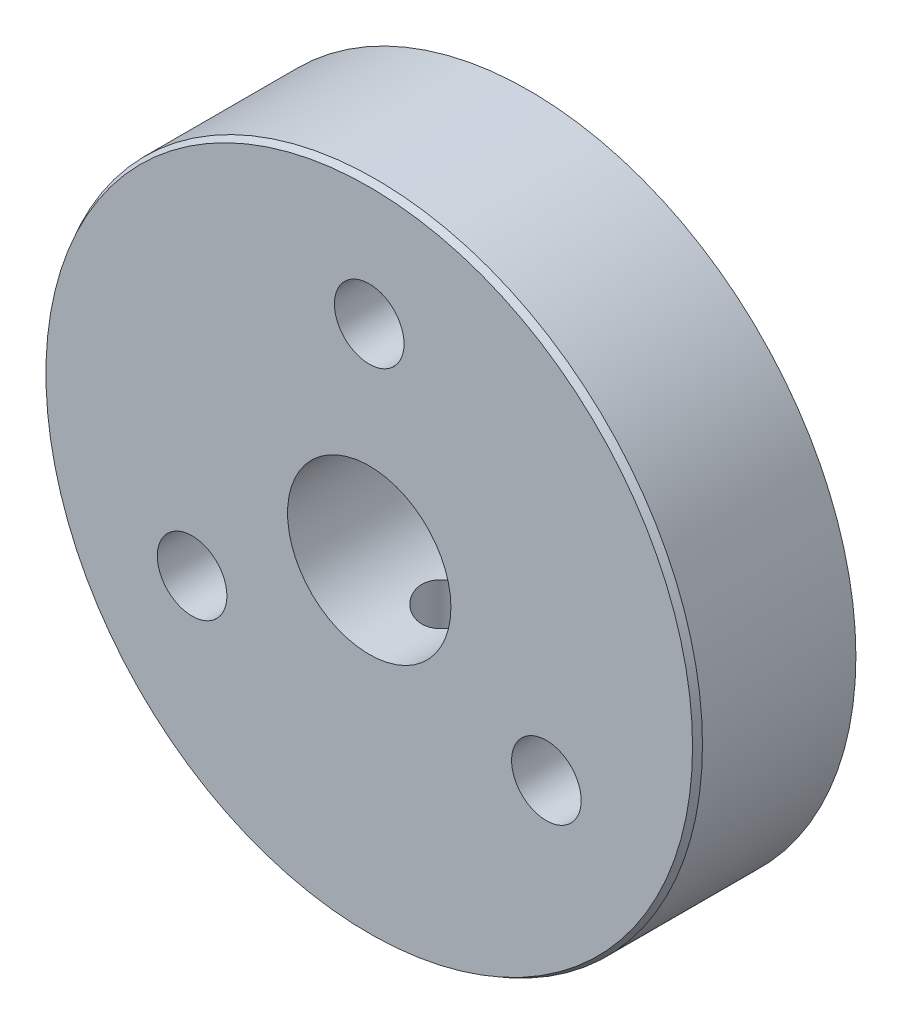
ISO-10303-21;
HEADER;
FILE_DESCRIPTION(('STEP AP214'),'2;1');
FILE_NAME('part.step','',(''),(''),'','','');
FILE_SCHEMA(('AUTOMOTIVE_DESIGN { 1 0 10303 214 1 1 1 1 }'));
ENDSEC;
DATA;
#1=APPLICATION_CONTEXT('core data for automotive mechanical design processes');
#2=APPLICATION_PROTOCOL_DEFINITION('international standard','automotive_design',2000,#1);
#3=PRODUCT_CONTEXT('',#1,'mechanical');
#4=PRODUCT('Part','Part','',(#3));
#5=PRODUCT_RELATED_PRODUCT_CATEGORY('part','',(#4));
#6=PRODUCT_DEFINITION_FORMATION('','',#4);
#7=PRODUCT_DEFINITION_CONTEXT('part definition',#1,'design');
#8=PRODUCT_DEFINITION('design','',#6,#7);
#9=PRODUCT_DEFINITION_SHAPE('','',#8);
#10=(LENGTH_UNIT() NAMED_UNIT(*) SI_UNIT(.MILLI.,.METRE.));
#11=(NAMED_UNIT(*) PLANE_ANGLE_UNIT() SI_UNIT($,.RADIAN.));
#12=(NAMED_UNIT(*) SI_UNIT($,.STERADIAN.) SOLID_ANGLE_UNIT());
#13=UNCERTAINTY_MEASURE_WITH_UNIT(LENGTH_MEASURE(1.E-05),#10,'distance_accuracy_value','');
#14=(GEOMETRIC_REPRESENTATION_CONTEXT(3) GLOBAL_UNCERTAINTY_ASSIGNED_CONTEXT((#13)) GLOBAL_UNIT_ASSIGNED_CONTEXT((#10,
#11,#12)) REPRESENTATION_CONTEXT('',''));
#15=CARTESIAN_POINT('',(0.,0.,0.));
#16=DIRECTION('',(0.,0.,1.));
#17=DIRECTION('',(1.,0.,0.));
#18=AXIS2_PLACEMENT_3D('',#15,#16,#17);
#19=CARTESIAN_POINT('',(0.,0.,3.175));
#20=DIRECTION('',(0.,0.,1.));
#21=DIRECTION('',(1.,0.,0.));
#22=AXIS2_PLACEMENT_3D('',#19,#20,#21);
#23=PLANE('',#22);
#24=CARTESIAN_POINT('',(0.,7.9502,3.175));
#25=DIRECTION('',(0.,0.,1.));
#26=DIRECTION('',(1.,0.,0.));
#27=AXIS2_PLACEMENT_3D('',#24,#25,#26);
#28=CIRCLE('',#27,1.35255);
#29=CARTESIAN_POINT('',(1.35255000000003,7.9502,3.175));
#30=VERTEX_POINT('',#29);
#31=EDGE_CURVE('E118',#30,#30,#28,.T.);
#32=ORIENTED_EDGE('',*,*,#31,.F.);
#33=EDGE_LOOP('',(#32));
#34=FACE_BOUND('',#33,.T.);
#35=CARTESIAN_POINT('',(6.88507516516696,-3.97510000000015,3.175));
#36=DIRECTION('',(0.,0.,1.));
#37=DIRECTION('',(1.,0.,0.));
#38=AXIS2_PLACEMENT_3D('',#35,#36,#37);
#39=CIRCLE('',#38,1.35255);
#40=CARTESIAN_POINT('',(8.23762516516696,-3.97510000000015,3.175));
#41=VERTEX_POINT('',#40);
#42=EDGE_CURVE('E110',#41,#41,#39,.T.);
#43=ORIENTED_EDGE('',*,*,#42,.F.);
#44=EDGE_LOOP('',(#43));
#45=FACE_BOUND('',#44,.T.);
#46=CARTESIAN_POINT('',(-6.88507516516706,-3.97509999999997,3.175));
#47=DIRECTION('',(0.,0.,1.));
#48=DIRECTION('',(1.,0.,0.));
#49=AXIS2_PLACEMENT_3D('',#46,#47,#48);
#50=CIRCLE('',#49,1.35255);
#51=CARTESIAN_POINT('',(-5.53252516516706,-3.97509999999997,3.175));
#52=VERTEX_POINT('',#51);
#53=EDGE_CURVE('E103',#52,#52,#50,.T.);
#54=ORIENTED_EDGE('',*,*,#53,.F.);
#55=EDGE_LOOP('',(#54));
#56=FACE_BOUND('',#55,.T.);
#57=CARTESIAN_POINT('',(0.,0.,3.175));
#58=DIRECTION('',(0.,0.,1.));
#59=DIRECTION('',(1.,0.,0.));
#60=AXIS2_PLACEMENT_3D('',#57,#58,#59);
#61=CIRCLE('',#60,12.5677759691599);
#62=CARTESIAN_POINT('',(12.5677759691599,0.,3.175));
#63=VERTEX_POINT('',#62);
#64=EDGE_CURVE('E87',#63,#63,#61,.T.);
#65=ORIENTED_EDGE('',*,*,#64,.T.);
#66=EDGE_LOOP('',(#65));
#67=FACE_BOUND('',#66,.T.);
#68=CARTESIAN_POINT('',(0.,0.,3.175));
#69=DIRECTION('',(0.,0.,1.));
#70=DIRECTION('',(1.,0.,0.));
#71=AXIS2_PLACEMENT_3D('',#68,#69,#70);
#72=CIRCLE('',#71,3.175);
#73=CARTESIAN_POINT('',(3.175,0.,3.175));
#74=VERTEX_POINT('',#73);
#75=EDGE_CURVE('E91',#74,#74,#72,.T.);
#76=ORIENTED_EDGE('',*,*,#75,.F.);
#77=EDGE_LOOP('',(#76));
#78=FACE_BOUND('',#77,.T.);
#79=ADVANCED_FACE('F52',(#34,#45,#56,#67,#78),#23,.T.);
#80=CARTESIAN_POINT('',(0.,0.,-3.175));
#81=DIRECTION('',(0.,0.,1.));
#82=DIRECTION('',(1.,0.,0.));
#83=AXIS2_PLACEMENT_3D('',#80,#81,#82);
#84=PLANE('',#83);
#85=CARTESIAN_POINT('',(0.,7.9502,-3.175));
#86=DIRECTION('',(0.,0.,1.));
#87=DIRECTION('',(1.,0.,0.));
#88=AXIS2_PLACEMENT_3D('',#85,#86,#87);
#89=CIRCLE('',#88,1.35255);
#90=CARTESIAN_POINT('',(1.35255000000003,7.9502,-3.175));
#91=VERTEX_POINT('',#90);
#92=EDGE_CURVE('E114',#91,#91,#89,.T.);
#93=ORIENTED_EDGE('',*,*,#92,.T.);
#94=EDGE_LOOP('',(#93));
#95=FACE_BOUND('',#94,.T.);
#96=CARTESIAN_POINT('',(6.88507516516696,-3.97510000000015,-3.175));
#97=DIRECTION('',(0.,0.,1.));
#98=DIRECTION('',(1.,0.,0.));
#99=AXIS2_PLACEMENT_3D('',#96,#97,#98);
#100=CIRCLE('',#99,1.35255);
#101=CARTESIAN_POINT('',(8.23762516516696,-3.97510000000015,-3.175));
#102=VERTEX_POINT('',#101);
#103=EDGE_CURVE('E107',#102,#102,#100,.T.);
#104=ORIENTED_EDGE('',*,*,#103,.T.);
#105=EDGE_LOOP('',(#104));
#106=FACE_BOUND('',#105,.T.);
#107=CARTESIAN_POINT('',(-6.88507516516706,-3.97509999999997,-3.175));
#108=DIRECTION('',(0.,0.,1.));
#109=DIRECTION('',(1.,0.,0.));
#110=AXIS2_PLACEMENT_3D('',#107,#108,#109);
#111=CIRCLE('',#110,1.35255);
#112=CARTESIAN_POINT('',(-5.53252516516706,-3.97509999999997,-3.175));
#113=VERTEX_POINT('',#112);
#114=EDGE_CURVE('E96',#113,#113,#111,.T.);
#115=ORIENTED_EDGE('',*,*,#114,.T.);
#116=EDGE_LOOP('',(#115));
#117=FACE_BOUND('',#116,.T.);
#118=CARTESIAN_POINT('',(0.,0.,-3.175));
#119=DIRECTION('',(0.,0.,1.));
#120=DIRECTION('',(1.,0.,0.));
#121=AXIS2_PLACEMENT_3D('',#118,#119,#120);
#122=CIRCLE('',#121,12.446);
#123=CARTESIAN_POINT('',(12.446,0.,-3.175));
#124=VERTEX_POINT('',#123);
#125=EDGE_CURVE('E66',#124,#124,#122,.F.);
#126=ORIENTED_EDGE('',*,*,#125,.T.);
#127=EDGE_LOOP('',(#126));
#128=FACE_BOUND('',#127,.T.);
#129=CARTESIAN_POINT('',(0.,0.,-3.175));
#130=DIRECTION('',(0.,0.,1.));
#131=DIRECTION('',(1.,0.,0.));
#132=AXIS2_PLACEMENT_3D('',#129,#130,#131);
#133=CIRCLE('',#132,3.175);
#134=CARTESIAN_POINT('',(3.175,0.,-3.175));
#135=VERTEX_POINT('',#134);
#136=EDGE_CURVE('E92',#135,#135,#133,.T.);
#137=ORIENTED_EDGE('',*,*,#136,.T.);
#138=EDGE_LOOP('',(#137));
#139=FACE_BOUND('',#138,.T.);
#140=ADVANCED_FACE('F151',(#95,#106,#117,#128,#139),#84,.F.);
#141=CARTESIAN_POINT('',(0.,0.,3.175));
#142=DIRECTION('',(0.,0.,-1.));
#143=DIRECTION('',(-1.,0.,0.));
#144=AXIS2_PLACEMENT_3D('',#141,#142,#143);
#145=CYLINDRICAL_SURFACE('',#144,12.7);
#146=CARTESIAN_POINT('',(-1.01856599499896,-12.6590885794555,-1.01455469719306));
#147=CARTESIAN_POINT('',(-1.06777935996552,-12.6551289481404,-0.9602667270985));
#148=CARTESIAN_POINT('',(-1.11288456501695,-12.651211115827,-0.902219990724273));
#149=CARTESIAN_POINT('',(-1.19403357340193,-12.6438107010971,-0.780033012646186));
#150=CARTESIAN_POINT('',(-1.23006837411032,-12.6403285528189,-0.715886803345802));
#151=CARTESIAN_POINT('',(-1.29651083842735,-12.6336979635186,-0.57424882101493));
#152=CARTESIAN_POINT('',(-1.32555920488906,-12.6306533053362,-0.496110456718519));
#153=CARTESIAN_POINT('',(-1.37057776919976,-12.6258477472939,-0.336115955753952));
#154=CARTESIAN_POINT('',(-1.3865448955865,-12.6240871489408,-0.254258950711837));
#155=CARTESIAN_POINT('',(-1.40532031918826,-12.6220113395381,-0.0867678463022914));
#156=CARTESIAN_POINT('',(-1.40775905049329,-12.6217367271964,-0.00109156300284166));
#157=CARTESIAN_POINT('',(-1.39842856543426,-12.6227737863963,0.169476775339011));
#158=CARTESIAN_POINT('',(-1.3866585193942,-12.6240855505692,0.254368784294553));
#159=CARTESIAN_POINT('',(-1.34901934120854,-12.6281631934404,0.421631019079898));
#160=CARTESIAN_POINT('',(-1.32304187235654,-12.6309402396324,0.503976664085946));
#161=CARTESIAN_POINT('',(-1.25749687040558,-12.6376335191431,0.663032295279327));
#162=CARTESIAN_POINT('',(-1.21792937904054,-12.6415497489635,0.739742298772402));
#163=CARTESIAN_POINT('',(-1.1267581566759,-12.6499990559549,0.88415968335355));
#164=CARTESIAN_POINT('',(-1.07532475103146,-12.6545230574904,0.951974949778696));
#165=CARTESIAN_POINT('',(-0.961400783980244,-12.6636867746431,1.07758271499526));
#166=CARTESIAN_POINT('',(-0.898912341269262,-12.6683264679419,1.13537713008602));
#167=CARTESIAN_POINT('',(-0.767006606972737,-12.6769831684423,1.23698526581895));
#168=CARTESIAN_POINT('',(-0.697922745648417,-12.681016654809,1.28122996568699));
#169=CARTESIAN_POINT('',(-0.552982890773223,-12.6881621868982,1.35682679815604));
#170=CARTESIAN_POINT('',(-0.477129191132589,-12.6912745432077,1.38818327780107));
#171=CARTESIAN_POINT('',(-0.32478372848182,-12.6960638396279,1.43555286393101));
#172=CARTESIAN_POINT('',(-0.248502877593077,-12.6978032940712,1.45223872832953));
#173=CARTESIAN_POINT('',(-0.0941899566152355,-12.6998848216853,1.47214085010944));
#174=CARTESIAN_POINT('',(-0.0161583044664618,-12.7002272248569,1.47536028843215));
#175=CARTESIAN_POINT('',(0.136652858436766,-12.6994870933027,1.46832741707033));
#176=CARTESIAN_POINT('',(0.211453702272819,-12.6984519399579,1.45852308369543));
#177=CARTESIAN_POINT('',(0.358341870872775,-12.6951561732157,1.42659289105142));
#178=CARTESIAN_POINT('',(0.430429235475015,-12.6928955778173,1.40446721275529));
#179=CARTESIAN_POINT('',(0.570187088972885,-12.6873874598792,1.34859162903364));
#180=CARTESIAN_POINT('',(0.637841262835307,-12.684136516135,1.31480137301867));
#181=CARTESIAN_POINT('',(0.766764961308602,-12.6769967660973,1.23674713548987));
#182=CARTESIAN_POINT('',(0.82803351837979,-12.6731078633702,1.19248157008545));
#183=CARTESIAN_POINT('',(0.944880939297458,-12.6649421632559,1.09304114172753));
#184=CARTESIAN_POINT('',(1.00016981793522,-12.6606563817003,1.03752654405262));
#185=CARTESIAN_POINT('',(1.10114484432322,-12.6522746357751,0.918352947369969));
#186=CARTESIAN_POINT('',(1.14682889220139,-12.648178713066,0.854692172274255));
#187=CARTESIAN_POINT('',(1.22955117035318,-12.6404120349761,0.717817186822992));
#188=CARTESIAN_POINT('',(1.26608215021364,-12.6367703091586,0.644294596924393));
#189=CARTESIAN_POINT('',(1.32680592005392,-12.6305392322281,0.492278273812366));
#190=CARTESIAN_POINT('',(1.35099641179657,-12.6279500771593,0.413783617681345));
#191=CARTESIAN_POINT('',(1.38716913168147,-12.6240290574787,0.251081374436562));
#192=CARTESIAN_POINT('',(1.39869060477786,-12.6227447663364,0.166769936497564));
#193=CARTESIAN_POINT('',(1.4077254209835,-12.6217403560962,-0.00261298018836294));
#194=CARTESIAN_POINT('',(1.40523720852784,-12.6220204106955,-0.0876845422885616));
#195=CARTESIAN_POINT('',(1.38616427795824,-12.6241293503412,-0.257475802201915));
#196=CARTESIAN_POINT('',(1.36937490554097,-12.6259807200312,-0.342172355019299));
#197=CARTESIAN_POINT('',(1.32179639132477,-12.631049926044,-0.507504436863517));
#198=CARTESIAN_POINT('',(1.29100687275052,-12.6342677991422,-0.588139856531279));
#199=CARTESIAN_POINT('',(1.21636932432176,-12.641670655105,-0.742446131312238));
#200=CARTESIAN_POINT('',(1.17260623426251,-12.6458493088541,-0.816158302750123));
#201=CARTESIAN_POINT('',(1.07298510911216,-12.6546905969574,-0.954880966479328));
#202=CARTESIAN_POINT('',(1.01712854059988,-12.6593531725905,-1.01989251235192));
#203=CARTESIAN_POINT('',(0.896536093161028,-12.668455483673,-1.13725892611313));
#204=CARTESIAN_POINT('',(0.832105153555628,-12.6728977584332,-1.18992650297639));
#205=CARTESIAN_POINT('',(0.694921562684951,-12.6811589075347,-1.28306989202841));
#206=CARTESIAN_POINT('',(0.622171498875595,-12.6849779748171,-1.32354948083279));
#207=CARTESIAN_POINT('',(0.474085698717592,-12.6913541717671,-1.3891414405637));
#208=CARTESIAN_POINT('',(0.399032778063965,-12.6939622321142,-1.41488736754523));
#209=CARTESIAN_POINT('',(0.24555252831014,-12.6978575095129,-1.45285210271825));
#210=CARTESIAN_POINT('',(0.167126284837625,-12.6991451482471,-1.46507522957532));
#211=CARTESIAN_POINT('',(0.0126513729709438,-12.700218829601,-1.4752828972933));
#212=CARTESIAN_POINT('',(-0.0633594548010816,-12.7000654537086,-1.47384186666785));
#213=CARTESIAN_POINT('',(-0.214037788189186,-12.6984197524929,-1.45814822237988));
#214=CARTESIAN_POINT('',(-0.288705207681909,-12.6969273416362,-1.44389479030261));
#215=CARTESIAN_POINT('',(-0.433884111852518,-12.6927923295812,-1.40330674867784));
#216=CARTESIAN_POINT('',(-0.504427574104128,-12.6901604630619,-1.37708477128717));
#217=CARTESIAN_POINT('',(-0.640224581249642,-12.6840345280549,-1.31352121902724));
#218=CARTESIAN_POINT('',(-0.70548127451704,-12.6805409778056,-1.27618632496805));
#219=CARTESIAN_POINT('',(-0.813319304512204,-12.674014610559,-1.202452409577));
#220=CARTESIAN_POINT('',(-0.857433192243053,-12.6710922637695,-1.16825325335951));
#221=CARTESIAN_POINT('',(-0.941344620762744,-12.6651347320017,-1.09494476980917));
#222=CARTESIAN_POINT('',(-0.981143062828058,-12.6620995707631,-1.05583647144129));
#223=CARTESIAN_POINT('',(-1.01856599499896,-12.6590885794555,-1.01455469719306));
#224=B_SPLINE_CURVE_WITH_KNOTS('',3,(#146,#147,#148,#149,#150,#151,#152,#153,#154,#155,#156,
#157,#158,#159,#160,#161,#162,#163,#164,#165,#166,#167,#168,#169,#170,#171,#172,#173,#174,#175,
#176,#177,#178,#179,#180,#181,#182,#183,#184,#185,#186,#187,#188,#189,#190,#191,#192,#193,#194,
#195,#196,#197,#198,#199,#200,#201,#202,#203,#204,#205,#206,#207,#208,#209,#210,#211,#212,#213,
#214,#215,#216,#217,#218,#219,#220,#221,#222,#223),.UNSPECIFIED.,.T.,.F.,(4,2,2,2,2,2,2,2,2,2,2,
2,2,2,2,2,2,2,2,2,2,2,2,2,2,2,2,2,2,2,2,2,2,2,2,2,2,2,4),(0.,0.219980916490328,
0.440179316710136,0.689278460018113,0.938436074809918,1.19436780396887,1.45031447816351,
1.70824061445378,1.96616595867985,2.22059701230149,2.4749793569785,2.72013710595396,
2.96521209813486,3.19835386278341,3.4314405532674,3.65671381484796,3.88198376775563,
4.10804092486646,4.33413228419696,4.56849124234626,4.80290138445377,5.04832845767661,
5.29380122146604,5.54793317280883,5.80209334223966,6.05995293592681,6.31781946960427,
6.57403366044263,6.83021679751475,7.07896081801577,7.32762768225191,7.564591796646,
7.80148021189261,8.02845571544188,8.25544571848217,8.48034228453971,8.70510392048968,
8.87241728997574,9.03969564865547),.UNSPECIFIED.);
#225=CARTESIAN_POINT('',(-1.01856599499896,-12.6590885794555,-1.01455469719306));
#226=VERTEX_POINT('',#225);
#227=EDGE_CURVE('E10',#226,#226,#224,.T.);
#228=ORIENTED_EDGE('',*,*,#227,.T.);
#229=EDGE_LOOP('',(#228));
#230=FACE_BOUND('',#229,.T.);
#231=CARTESIAN_POINT('',(0.,0.,2.92099999999999));
#232=DIRECTION('',(0.,0.,1.));
#233=DIRECTION('',(1.,0.,0.));
#234=AXIS2_PLACEMENT_3D('',#231,#232,#233);
#235=CIRCLE('',#234,12.7);
#236=CARTESIAN_POINT('',(12.7,0.,2.92099999999999));
#237=VERTEX_POINT('',#236);
#238=EDGE_CURVE('E74',#237,#237,#235,.F.);
#239=ORIENTED_EDGE('',*,*,#238,.T.);
#240=EDGE_LOOP('',(#239));
#241=FACE_BOUND('',#240,.T.);
#242=CARTESIAN_POINT('',(0.,0.,-3.04277596915985));
#243=DIRECTION('',(0.,0.,1.));
#244=DIRECTION('',(1.,0.,0.));
#245=AXIS2_PLACEMENT_3D('',#242,#243,#244);
#246=CIRCLE('',#245,12.7);
#247=CARTESIAN_POINT('',(12.7,0.,-3.04277596915985));
#248=VERTEX_POINT('',#247);
#249=EDGE_CURVE('E81',#248,#248,#246,.T.);
#250=ORIENTED_EDGE('',*,*,#249,.T.);
#251=EDGE_LOOP('',(#250));
#252=FACE_BOUND('',#251,.T.);
#253=ADVANCED_FACE('F156',(#230,#241,#252),#145,.T.);
#254=CARTESIAN_POINT('',(0.,0.,3.175));
#255=DIRECTION('',(0.,0.,-1.));
#256=DIRECTION('',(-1.,0.,0.));
#257=AXIS2_PLACEMENT_3D('',#254,#255,#256);
#258=CYLINDRICAL_SURFACE('',#257,3.175);
#259=CARTESIAN_POINT('',(0.,-3.175,-1.1303));
#260=CARTESIAN_POINT('',(-0.0614285544766779,-3.17500087649076,-1.13030122375743));
#261=CARTESIAN_POINT('',(-0.122848391480888,-3.17320130070143,-1.12527632101687));
#262=CARTESIAN_POINT('',(-0.243864611742385,-3.1662010034201,-1.10538141456425));
#263=CARTESIAN_POINT('',(-0.303461052111787,-3.16100038856924,-1.09051171954004));
#264=CARTESIAN_POINT('',(-0.419068309151047,-3.14775949893737,-1.05151155002785));
#265=CARTESIAN_POINT('',(-0.475085403185977,-3.13972436624609,-1.02739783825833));
#266=CARTESIAN_POINT('',(-0.582278041616506,-3.12162393487057,-0.970674959877598));
#267=CARTESIAN_POINT('',(-0.633452431498653,-3.11155815385673,-0.938063774366824));
#268=CARTESIAN_POINT('',(-0.731495005230031,-3.09000790855595,-0.863944920073516));
#269=CARTESIAN_POINT('',(-0.778149616243898,-3.07848610582585,-0.822165683101444));
#270=CARTESIAN_POINT('',(-0.863958107942659,-3.055516031792,-0.731473458691628));
#271=CARTESIAN_POINT('',(-0.903110009958691,-3.04406778065305,-0.682558595368709));
#272=CARTESIAN_POINT('',(-0.974093633832357,-3.02211785986225,-0.576974309823008));
#273=CARTESIAN_POINT('',(-1.00563502809097,-3.01166094904186,-0.520099481666731));
#274=CARTESIAN_POINT('',(-1.0586113470591,-2.99345244738711,-0.401420602400137));
#275=CARTESIAN_POINT('',(-1.08004985661479,-2.98569989720789,-0.339618308836504));
#276=CARTESIAN_POINT('',(-1.11138819305283,-2.9741742173714,-0.215285055150901));
#277=CARTESIAN_POINT('',(-1.12169236541681,-2.97026214805178,-0.152869300216101));
#278=CARTESIAN_POINT('',(-1.13173392893205,-2.96645158379256,-0.0270815214047249));
#279=CARTESIAN_POINT('',(-1.13147514856467,-2.96655163468287,0.0362901476816091));
#280=CARTESIAN_POINT('',(-1.12070953557278,-2.97063328242024,0.158613366101805));
#281=CARTESIAN_POINT('',(-1.11074743190181,-2.9744085523292,0.21762097911382));
#282=CARTESIAN_POINT('',(-1.08175290027524,-2.98507483987672,0.333064642409357));
#283=CARTESIAN_POINT('',(-1.06271924100948,-2.99196628047622,0.389500342459561));
#284=CARTESIAN_POINT('',(-1.01579639288465,-3.00822311818093,0.499367623295951));
#285=CARTESIAN_POINT('',(-0.987756625641375,-3.01763009039321,0.552728473537324));
#286=CARTESIAN_POINT('',(-0.923722187948486,-3.03784253722576,0.654152260726013));
#287=CARTESIAN_POINT('',(-0.887724971743381,-3.04864845893998,0.702213494822719));
#288=CARTESIAN_POINT('',(-0.806247147627666,-3.0712342285018,0.794711224911271));
#289=CARTESIAN_POINT('',(-0.760326653485441,-3.08303358094073,0.83875635543315));
#290=CARTESIAN_POINT('',(-0.661610098844968,-3.10571393948941,0.918630406902953));
#291=CARTESIAN_POINT('',(-0.60881318146775,-3.11659483086972,0.954458302353039));
#292=CARTESIAN_POINT('',(-0.496923650490421,-3.13639217173446,1.01725643876643));
#293=CARTESIAN_POINT('',(-0.437759573781158,-3.14528190725224,1.04410836273789));
#294=CARTESIAN_POINT('',(-0.315359989841962,-3.15989936928577,1.08735200192041));
#295=CARTESIAN_POINT('',(-0.252126116160289,-3.16562835574328,1.10374788553834));
#296=CARTESIAN_POINT('',(-0.126684885961715,-3.17306329879329,1.12488948929031));
#297=CARTESIAN_POINT('',(-0.0645771816882164,-3.17495136824996,1.1301630443381));
#298=CARTESIAN_POINT('',(0.0596565359676967,-3.17504672531149,1.13043160042333));
#299=CARTESIAN_POINT('',(0.121782543364873,-3.1732547352019,1.12542861843736));
#300=CARTESIAN_POINT('',(0.242087689559501,-3.16631168752833,1.10569555255757));
#301=CARTESIAN_POINT('',(0.30032923111041,-3.16127656517542,1.09130097687732));
#302=CARTESIAN_POINT('',(0.413538192846499,-3.14846933320479,1.05362458392996));
#303=CARTESIAN_POINT('',(0.468505187040127,-3.14069686838655,1.03034161326217));
#304=CARTESIAN_POINT('',(0.575332725471091,-3.12292068057346,0.974831097632251));
#305=CARTESIAN_POINT('',(0.627062417893483,-3.11286035066926,0.942370399820989));
#306=CARTESIAN_POINT('',(0.724505279210261,-3.09163517782237,0.86969392625776));
#307=CARTESIAN_POINT('',(0.770216385550682,-3.08046995852104,0.829475503532218));
#308=CARTESIAN_POINT('',(0.856811848575499,-3.05754963314883,0.739951586358952));
#309=CARTESIAN_POINT('',(0.89732026123192,-3.0457941243994,0.690281624884846));
#310=CARTESIAN_POINT('',(0.969488296473175,-3.02359841598846,0.584605887343713));
#311=CARTESIAN_POINT('',(1.00114750732455,-3.01315827754058,0.528599816642027));
#312=CARTESIAN_POINT('',(1.0546547707943,-2.99485112677041,0.411607263091931));
#313=CARTESIAN_POINT('',(1.07649405053024,-2.98698641696941,0.350616384187454));
#314=CARTESIAN_POINT('',(1.1094694490286,-2.97489781303426,0.225470366059666));
#315=CARTESIAN_POINT('',(1.1206113170349,-2.97067196334806,0.161316946034553));
#316=CARTESIAN_POINT('',(1.13139068963521,-2.96658222044346,0.0356943439521811));
#317=CARTESIAN_POINT('',(1.13166111008653,-2.96647835747859,-0.0257132404761808));
#318=CARTESIAN_POINT('',(1.12228164306422,-2.97003931415378,-0.147648882354413));
#319=CARTESIAN_POINT('',(1.11263251765991,-2.97370384428697,-0.208177007006533));
#320=CARTESIAN_POINT('',(1.08416089230555,-2.98419839475885,-0.325127051192539));
#321=CARTESIAN_POINT('',(1.06557142470547,-2.99094779649679,-0.38161353131441));
#322=CARTESIAN_POINT('',(1.01994372799953,-3.0068123311106,-0.49070459232397));
#323=CARTESIAN_POINT('',(0.992903472899546,-3.01592803119462,-0.543308238597662));
#324=CARTESIAN_POINT('',(0.929616151238461,-3.03604854272463,-0.645909488675432));
#325=CARTESIAN_POINT('',(0.892986233526775,-3.0471235224069,-0.695657048848299));
#326=CARTESIAN_POINT('',(0.812177154252536,-3.06964995874745,-0.788502707435913));
#327=CARTESIAN_POINT('',(0.767995717285477,-3.08110152803636,-0.831598794175539));
#328=CARTESIAN_POINT('',(0.670861718733729,-3.10373428576573,-0.911963578799143));
#329=CARTESIAN_POINT('',(0.617595515492278,-3.11487776157142,-0.948865332174022));
#330=CARTESIAN_POINT('',(0.505234578584047,-3.13506244460878,-1.01316548821053));
#331=CARTESIAN_POINT('',(0.446140340356565,-3.14410383031939,-1.04056469778738));
#332=CARTESIAN_POINT('',(0.323645197027849,-3.15906443826106,-1.08493350082546));
#333=CARTESIAN_POINT('',(0.260236860921375,-3.16497811106267,-1.10188456513346));
#334=CARTESIAN_POINT('',(0.131215131612621,-3.17294468299437,-1.12456500771492));
#335=CARTESIAN_POINT('',(0.0656025945972248,-3.17499906395212,-1.13029869308885));
#336=CARTESIAN_POINT('',(0.,-3.175,-1.1303));
#337=B_SPLINE_CURVE_WITH_KNOTS('',3,(#259,#260,#261,#262,#263,#264,#265,#266,#267,#268,#269,
#270,#271,#272,#273,#274,#275,#276,#277,#278,#279,#280,#281,#282,#283,#284,#285,#286,#287,#288,
#289,#290,#291,#292,#293,#294,#295,#296,#297,#298,#299,#300,#301,#302,#303,#304,#305,#306,#307,
#308,#309,#310,#311,#312,#313,#314,#315,#316,#317,#318,#319,#320,#321,#322,#323,#324,#325,#326,
#327,#328,#329,#330,#331,#332,#333,#334,#335,#336),.UNSPECIFIED.,.T.,.F.,(4,2,2,2,2,2,2,2,2,2,2,
2,2,2,2,2,2,2,2,2,2,2,2,2,2,2,2,2,2,2,2,2,2,2,2,2,2,2,4),(0.,0.18404394145956,0.368082112412806,
0.551788122807083,0.735537819443366,0.925722644883205,1.11595755842548,1.31258758821648,
1.50914779437035,1.69830149435247,1.88738663727476,2.06643452933681,2.24550673104465,
2.42774410221586,2.61003985955346,2.80329006106037,2.99656436677723,3.19229416831945,
3.3879458913255,3.57408187032768,3.7601813198999,3.93997181359128,4.11978564569259,
4.30465683345396,4.48959121210529,4.68416822385536,4.8787542873297,5.07351384543878,
5.26816867279116,5.45147357003618,5.63476438593103,5.81351722268549,5.99231294661076,
6.179778260035,6.36730015993202,6.56359488860405,6.75987294468714,6.95649809396631,
7.15304773089828),.UNSPECIFIED.);
#338=CARTESIAN_POINT('',(0.,-3.175,-1.1303));
#339=VERTEX_POINT('',#338);
#340=EDGE_CURVE('E122',#339,#339,#337,.T.);
#341=ORIENTED_EDGE('',*,*,#340,.F.);
#342=EDGE_LOOP('',(#341));
#343=FACE_BOUND('',#342,.T.);
#344=ORIENTED_EDGE('',*,*,#75,.T.);
#345=EDGE_LOOP('',(#344));
#346=FACE_BOUND('',#345,.T.);
#347=ORIENTED_EDGE('',*,*,#136,.F.);
#348=EDGE_LOOP('',(#347));
#349=FACE_BOUND('',#348,.T.);
#350=ADVANCED_FACE('F162',(#343,#346,#349),#258,.F.);
#351=CARTESIAN_POINT('',(0.,0.,3.175));
#352=DIRECTION('',(0.,0.,-1.));
#353=DIRECTION('',(-1.,0.,0.));
#354=AXIS2_PLACEMENT_3D('',#351,#352,#353);
#355=CONICAL_SURFACE('',#354,12.5677759691599,0.479965544298438);
#356=ORIENTED_EDGE('',*,*,#238,.F.);
#357=EDGE_LOOP('',(#356));
#358=FACE_BOUND('',#357,.T.);
#359=ORIENTED_EDGE('',*,*,#64,.F.);
#360=EDGE_LOOP('',(#359));
#361=FACE_BOUND('',#360,.T.);
#362=ADVANCED_FACE('F167',(#358,#361),#355,.T.);
#363=CARTESIAN_POINT('',(0.,0.,-3.04277596915985));
#364=DIRECTION('',(0.,0.,1.));
#365=DIRECTION('',(1.,0.,0.));
#366=AXIS2_PLACEMENT_3D('',#363,#364,#365);
#367=CONICAL_SURFACE('',#366,12.7,1.09083078249646);
#368=ORIENTED_EDGE('',*,*,#125,.F.);
#369=EDGE_LOOP('',(#368));
#370=FACE_BOUND('',#369,.T.);
#371=ORIENTED_EDGE('',*,*,#249,.F.);
#372=EDGE_LOOP('',(#371));
#373=FACE_BOUND('',#372,.T.);
#374=ADVANCED_FACE('F55',(#370,#373),#367,.T.);
#375=CARTESIAN_POINT('',(-6.88507516516706,-3.97509999999997,3.175));
#376=DIRECTION('',(0.,0.,1.));
#377=DIRECTION('',(1.,0.,0.));
#378=AXIS2_PLACEMENT_3D('',#375,#376,#377);
#379=CYLINDRICAL_SURFACE('',#378,1.35255);
#380=ORIENTED_EDGE('',*,*,#114,.F.);
#381=EDGE_LOOP('',(#380));
#382=FACE_BOUND('',#381,.T.);
#383=ORIENTED_EDGE('',*,*,#53,.T.);
#384=EDGE_LOOP('',(#383));
#385=FACE_BOUND('',#384,.T.);
#386=ADVANCED_FACE('F175',(#382,#385),#379,.F.);
#387=CARTESIAN_POINT('',(6.88507516516696,-3.97510000000015,3.175));
#388=DIRECTION('',(0.,0.,1.));
#389=DIRECTION('',(1.,0.,0.));
#390=AXIS2_PLACEMENT_3D('',#387,#388,#389);
#391=CYLINDRICAL_SURFACE('',#390,1.35255);
#392=ORIENTED_EDGE('',*,*,#103,.F.);
#393=EDGE_LOOP('',(#392));
#394=FACE_BOUND('',#393,.T.);
#395=ORIENTED_EDGE('',*,*,#42,.T.);
#396=EDGE_LOOP('',(#395));
#397=FACE_BOUND('',#396,.T.);
#398=ADVANCED_FACE('F146',(#394,#397),#391,.F.);
#399=CARTESIAN_POINT('',(0.,7.9502,3.175));
#400=DIRECTION('',(0.,0.,1.));
#401=DIRECTION('',(1.,0.,0.));
#402=AXIS2_PLACEMENT_3D('',#399,#400,#401);
#403=CYLINDRICAL_SURFACE('',#402,1.35255);
#404=ORIENTED_EDGE('',*,*,#92,.F.);
#405=EDGE_LOOP('',(#404));
#406=FACE_BOUND('',#405,.T.);
#407=ORIENTED_EDGE('',*,*,#31,.T.);
#408=EDGE_LOOP('',(#407));
#409=FACE_BOUND('',#408,.T.);
#410=ADVANCED_FACE('F140',(#406,#409),#403,.F.);
#411=CARTESIAN_POINT('',(0.,-12.7,0.));
#412=DIRECTION('',(0.,-1.,0.));
#413=DIRECTION('',(0.,0.,-1.));
#414=AXIS2_PLACEMENT_3D('',#411,#412,#413);
#415=CONICAL_SURFACE('',#414,1.4732,0.715584993317677);
#416=CARTESIAN_POINT('',(0.,-12.3055386731639,0.));
#417=DIRECTION('',(0.,-1.,0.));
#418=DIRECTION('',(0.,0.,-1.));
#419=AXIS2_PLACEMENT_3D('',#416,#417,#418);
#420=CIRCLE('',#419,1.1303);
#421=CARTESIAN_POINT('',(0.,-12.3055386731639,-1.1303));
#422=VERTEX_POINT('',#421);
#423=EDGE_CURVE('E130',#422,#422,#420,.T.);
#424=ORIENTED_EDGE('',*,*,#423,.F.);
#425=EDGE_LOOP('',(#424));
#426=FACE_BOUND('',#425,.T.);
#427=ORIENTED_EDGE('',*,*,#227,.F.);
#428=EDGE_LOOP('',(#427));
#429=FACE_BOUND('',#428,.T.);
#430=ADVANCED_FACE('F136',(#426,#429),#415,.F.);
#431=CARTESIAN_POINT('',(0.,-12.7,0.));
#432=DIRECTION('',(0.,-1.,0.));
#433=DIRECTION('',(0.,0.,-1.));
#434=AXIS2_PLACEMENT_3D('',#431,#432,#433);
#435=CYLINDRICAL_SURFACE('',#434,1.1303);
#436=ORIENTED_EDGE('',*,*,#423,.T.);
#437=EDGE_LOOP('',(#436));
#438=FACE_BOUND('',#437,.T.);
#439=ORIENTED_EDGE('',*,*,#340,.T.);
#440=EDGE_LOOP('',(#439));
#441=FACE_BOUND('',#440,.T.);
#442=ADVANCED_FACE('F133',(#438,#441),#435,.F.);
#443=CLOSED_SHELL('',(#79,#140,#253,#350,#362,#374,#386,#398,#410,#430,#442));
#444=MANIFOLD_SOLID_BREP('B2',#443);
#445=ADVANCED_BREP_SHAPE_REPRESENTATION('',(#18,#444),#14);
#446=SHAPE_DEFINITION_REPRESENTATION(#9,#445);
ENDSEC;
END-ISO-10303-21;
